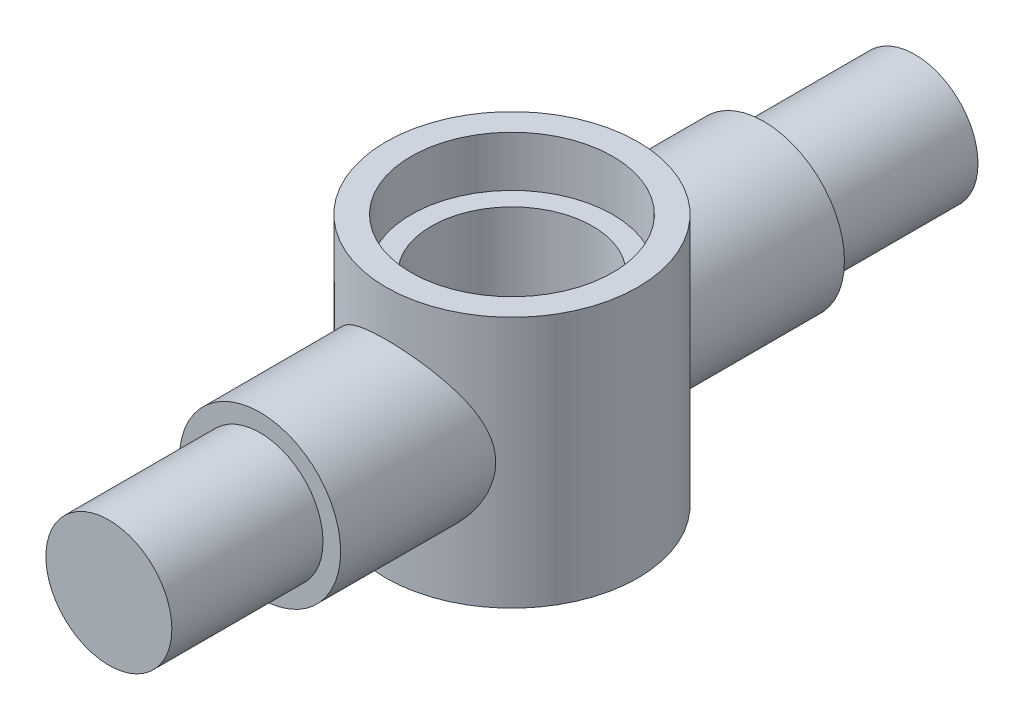
ISO-10303-21;
HEADER;
FILE_DESCRIPTION(('STEP AP214'),'2;1');
FILE_NAME('part.step','',(''),(''),'','','');
FILE_SCHEMA(('AUTOMOTIVE_DESIGN { 1 0 10303 214 1 1 1 1 }'));
ENDSEC;
DATA;
#1=APPLICATION_CONTEXT('core data for automotive mechanical design processes');
#2=APPLICATION_PROTOCOL_DEFINITION('international standard','automotive_design',2000,#1);
#3=PRODUCT_CONTEXT('',#1,'mechanical');
#4=PRODUCT('Part','Part','',(#3));
#5=PRODUCT_RELATED_PRODUCT_CATEGORY('part','',(#4));
#6=PRODUCT_DEFINITION_FORMATION('','',#4);
#7=PRODUCT_DEFINITION_CONTEXT('part definition',#1,'design');
#8=PRODUCT_DEFINITION('design','',#6,#7);
#9=PRODUCT_DEFINITION_SHAPE('','',#8);
#10=(LENGTH_UNIT() NAMED_UNIT(*) SI_UNIT(.MILLI.,.METRE.));
#11=(NAMED_UNIT(*) PLANE_ANGLE_UNIT() SI_UNIT($,.RADIAN.));
#12=(NAMED_UNIT(*) SI_UNIT($,.STERADIAN.) SOLID_ANGLE_UNIT());
#13=UNCERTAINTY_MEASURE_WITH_UNIT(LENGTH_MEASURE(1.E-05),#10,'distance_accuracy_value','');
#14=(GEOMETRIC_REPRESENTATION_CONTEXT(3) GLOBAL_UNCERTAINTY_ASSIGNED_CONTEXT((#13)) GLOBAL_UNIT_ASSIGNED_CONTEXT((#10,
#11,#12)) REPRESENTATION_CONTEXT('',''));
#15=CARTESIAN_POINT('',(0.,0.,0.));
#16=DIRECTION('',(0.,0.,1.));
#17=DIRECTION('',(1.,0.,0.));
#18=AXIS2_PLACEMENT_3D('',#15,#16,#17);
#19=CARTESIAN_POINT('',(0.,50.,0.));
#20=DIRECTION('',(0.,-1.,0.));
#21=DIRECTION('',(0.,0.,-1.));
#22=AXIS2_PLACEMENT_3D('',#19,#20,#21);
#23=CYLINDRICAL_SURFACE('',#22,25.);
#24=CARTESIAN_POINT('',(0.,50.,0.));
#25=DIRECTION('',(0.,1.,0.));
#26=DIRECTION('',(0.,0.,1.));
#27=AXIS2_PLACEMENT_3D('',#24,#25,#26);
#28=CIRCLE('',#27,25.);
#29=CARTESIAN_POINT('',(0.,50.,25.));
#30=VERTEX_POINT('',#29);
#31=EDGE_CURVE('E74',#30,#30,#28,.T.);
#32=ORIENTED_EDGE('',*,*,#31,.F.);
#33=EDGE_LOOP('',(#32));
#34=FACE_BOUND('',#33,.T.);
#35=CARTESIAN_POINT('',(0.,0.,0.));
#36=DIRECTION('',(0.,1.,0.));
#37=DIRECTION('',(0.,0.,1.));
#38=AXIS2_PLACEMENT_3D('',#35,#36,#37);
#39=CIRCLE('',#38,25.);
#40=CARTESIAN_POINT('',(0.,0.,25.));
#41=VERTEX_POINT('',#40);
#42=EDGE_CURVE('E69',#41,#41,#39,.T.);
#43=ORIENTED_EDGE('',*,*,#42,.T.);
#44=EDGE_LOOP('',(#43));
#45=FACE_BOUND('',#44,.T.);
#46=CARTESIAN_POINT('',(-16.,25.,19.2093727122985));
#47=CARTESIAN_POINT('',(-16.0000075518309,24.6045492581816,19.2093602004703));
#48=CARTESIAN_POINT('',(-15.985318558414,24.2091699772598,19.2216281701415));
#49=CARTESIAN_POINT('',(-15.9268763773465,23.421903187078,19.2700828129892));
#50=CARTESIAN_POINT('',(-15.8831138318214,23.0300168432567,19.3062771873145));
#51=CARTESIAN_POINT('',(-15.7672610060305,22.2525926454864,19.4010060093011));
#52=CARTESIAN_POINT('',(-15.695124927821,21.8670661104673,19.4595765701311));
#53=CARTESIAN_POINT('',(-15.5237584274562,21.1057493858748,19.5965538328847));
#54=CARTESIAN_POINT('',(-15.424528797624,20.7299589119321,19.6749599547327));
#55=CARTESIAN_POINT('',(-15.2013768268568,19.9935160869742,19.8478677138076));
#56=CARTESIAN_POINT('',(-15.0776843957441,19.6327580464953,19.9422183799563));
#57=CARTESIAN_POINT('',(-14.80639059605,18.924250129037,20.1444634718839));
#58=CARTESIAN_POINT('',(-14.6587856393959,18.5765022138799,20.2523599296603));
#59=CARTESIAN_POINT('',(-14.34092425358,17.895126630566,20.4786703313642));
#60=CARTESIAN_POINT('',(-14.1706687570999,17.5614983817486,20.5970838421642));
#61=CARTESIAN_POINT('',(-13.8085717175924,16.9091068308863,20.8415708471703));
#62=CARTESIAN_POINT('',(-13.6167287819958,16.5903444896942,20.9676448352993));
#63=CARTESIAN_POINT('',(-13.183726884198,15.9242806211114,21.2429784742916));
#64=CARTESIAN_POINT('',(-12.9394311786344,15.5793274314703,21.3929937414824));
#65=CARTESIAN_POINT('',(-12.4250119334488,14.910546335808,21.6958102059326));
#66=CARTESIAN_POINT('',(-12.1548867309956,14.5867197921224,21.8486115820407));
#67=CARTESIAN_POINT('',(-11.5895322792664,13.9609477949369,22.153690243193));
#68=CARTESIAN_POINT('',(-11.2942825562918,13.6590205653043,22.3059669935383));
#69=CARTESIAN_POINT('',(-10.6797634395583,13.0785353977139,22.6066292638259));
#70=CARTESIAN_POINT('',(-10.3604925764188,12.7999788915583,22.7550145449758));
#71=CARTESIAN_POINT('',(-9.65613685196289,12.2332924062818,23.0635047016872));
#72=CARTESIAN_POINT('',(-9.26787638476107,11.9485682189356,23.2226498605155));
#73=CARTESIAN_POINT('',(-8.46354327157018,11.4131743874628,23.5277165227615));
#74=CARTESIAN_POINT('',(-8.04746763026314,11.1625084197881,23.6736365980179));
#75=CARTESIAN_POINT('',(-7.19003859126286,10.6982235642847,23.9479803876146));
#76=CARTESIAN_POINT('',(-6.74870512893474,10.4845759809119,24.0764176374088));
#77=CARTESIAN_POINT('',(-5.84344355319203,10.0970999400992,24.311987912098));
#78=CARTESIAN_POINT('',(-5.37951982186269,9.92326379701105,24.4191250484791));
#79=CARTESIAN_POINT('',(-4.48282903672907,9.63438391379048,24.5985926447151));
#80=CARTESIAN_POINT('',(-4.05193075208176,9.51507500024326,24.6734013192139));
#81=CARTESIAN_POINT('',(-3.17853043332122,9.31249437499184,24.801040881362));
#82=CARTESIAN_POINT('',(-2.73602914024029,9.22922036781577,24.8538731689283));
#83=CARTESIAN_POINT('',(-1.84383752201984,9.10021251504481,24.9359332327917));
#84=CARTESIAN_POINT('',(-1.39415431610935,9.05444359259159,24.9651830643105));
#85=CARTESIAN_POINT('',(-0.491624497686981,9.00116975992862,24.9992426632786));
#86=CARTESIAN_POINT('',(-0.0387782840441687,8.99366010927911,25.0040554585505));
#87=CARTESIAN_POINT('',(0.801807020258257,9.01537545354764,24.9901621157745));
#88=CARTESIAN_POINT('',(1.18974170793274,9.03958043209938,24.9746698897481));
#89=CARTESIAN_POINT('',(1.96167918510343,9.11597662468062,24.925916743737));
#90=CARTESIAN_POINT('',(2.34568243394718,9.16816453027431,24.8926579243074));
#91=CARTESIAN_POINT('',(3.10709482157081,9.29983235826278,24.809124943467));
#92=CARTESIAN_POINT('',(3.48450368656138,9.37931341101356,24.7588500773314));
#93=CARTESIAN_POINT('',(4.23029490411503,9.56457796754724,24.6423835379046));
#94=CARTESIAN_POINT('',(4.59867687169072,9.67036259101151,24.5761911870474));
#95=CARTESIAN_POINT('',(5.3243786114757,9.90706404812005,24.429246979534));
#96=CARTESIAN_POINT('',(5.68169536247057,10.0379876765975,24.348491186878));
#97=CARTESIAN_POINT('',(6.38338290414122,10.3236269689296,24.1740178828328));
#98=CARTESIAN_POINT('',(6.72775387695177,10.4783422979018,24.0803005538868));
#99=CARTESIAN_POINT('',(7.40213203498125,10.8102257605063,23.88162522246));
#100=CARTESIAN_POINT('',(7.73213837982413,10.9873952054098,23.7766665635656));
#101=CARTESIAN_POINT('',(8.37663930224959,11.3628799931342,23.5573305378522));
#102=CARTESIAN_POINT('',(8.69113212810154,11.5611977159848,23.4429521112619));
#103=CARTESIAN_POINT('',(9.34261350029824,12.0042371177083,23.1916461498523));
#104=CARTESIAN_POINT('',(9.67737906939421,12.2516529122084,23.0537005367941));
#105=CARTESIAN_POINT('',(10.3249438913943,12.7702151284576,22.7710425195163));
#106=CARTESIAN_POINT('',(10.6377415534904,13.0413632655993,22.6263296265049));
#107=CARTESIAN_POINT('',(11.2408946521999,13.6064360220685,22.3328215884758));
#108=CARTESIAN_POINT('',(11.5312180082151,13.9003920427177,22.1840210043112));
#109=CARTESIAN_POINT('',(12.0880975088665,14.5096117899087,21.8855595984986));
#110=CARTESIAN_POINT('',(12.3546524680053,14.8248765778916,21.7358987343383));
#111=CARTESIAN_POINT('',(12.8986334479259,15.5212466263385,21.4181651432605));
#112=CARTESIAN_POINT('',(13.1723794101635,15.9053982409604,21.2504398360994));
#113=CARTESIAN_POINT('',(13.6863281692123,16.6989176047022,20.9231280377543));
#114=CARTESIAN_POINT('',(13.9265241972136,17.108290418343,20.7635431930463));
#115=CARTESIAN_POINT('',(14.3711052241852,17.9503518777134,20.4583462502362));
#116=CARTESIAN_POINT('',(14.5755420556062,18.3830055675749,20.3127140688785));
#117=CARTESIAN_POINT('',(14.8537397354869,19.0481785869778,20.1091927064436));
#118=CARTESIAN_POINT('',(14.9417198388729,19.2725716400392,20.043847548657));
#119=CARTESIAN_POINT('',(15.107928903543,19.7265824625255,19.9188677051513));
#120=CARTESIAN_POINT('',(15.1861554400349,19.9562015144521,19.8592344402921));
#121=CARTESIAN_POINT('',(15.3658713186935,20.5261329268779,19.720753651965));
#122=CARTESIAN_POINT('',(15.4616911152538,20.8691522212165,19.645552574875));
#123=CARTESIAN_POINT('',(15.6307339070693,21.5637409179206,19.5113255727846));
#124=CARTESIAN_POINT('',(15.7039626356712,21.9153081264513,19.4522955441895));
#125=CARTESIAN_POINT('',(15.8267893922012,22.6246848377517,19.3524938058948));
#126=CARTESIAN_POINT('',(15.8764165497243,22.9824860776706,19.3116995928931));
#127=CARTESIAN_POINT('',(15.9513955181358,23.7023398736547,19.2498146282199));
#128=CARTESIAN_POINT('',(15.9767470392006,24.0643924804241,19.2287241117882));
#129=CARTESIAN_POINT('',(16.0027787782538,24.7910859598436,19.2070655710883));
#130=CARTESIAN_POINT('',(16.0033853918814,25.1557313278929,19.2065587736387));
#131=CARTESIAN_POINT('',(15.9797303685735,25.8836464924773,19.2262437044411));
#132=CARTESIAN_POINT('',(15.9554686000853,26.2469162817255,19.2464355421881));
#133=CARTESIAN_POINT('',(15.8824686441804,26.9695650440577,19.306719348198));
#134=CARTESIAN_POINT('',(15.8337127062304,27.3289410021241,19.3468257479805));
#135=CARTESIAN_POINT('',(15.7124891921192,28.0410818833485,19.4454047345737));
#136=CARTESIAN_POINT('',(15.640021088041,28.3938466591333,19.5038777302888));
#137=CARTESIAN_POINT('',(15.4746735603332,29.081170032679,19.6353070822549));
#138=CARTESIAN_POINT('',(15.3824106552207,29.4159625021135,19.7078206333577));
#139=CARTESIAN_POINT('',(15.1773980264134,30.0760390487844,19.8661366285732));
#140=CARTESIAN_POINT('',(15.0646402631501,30.4013193363182,19.9519442856407));
#141=CARTESIAN_POINT('',(14.6970969552363,31.3611570206666,20.2259366590945));
#142=CARTESIAN_POINT('',(14.4129501324544,31.9800844569265,20.4307664709313));
#143=CARTESIAN_POINT('',(13.9025759153207,32.9297831111047,20.7791231934689));
#144=CARTESIAN_POINT('',(13.6990065677717,33.2763444691463,20.9141789774944));
#145=CARTESIAN_POINT('',(13.2676036626528,33.9515959954826,21.1904755475318));
#146=CARTESIAN_POINT('',(13.0397678161961,34.2802844735307,21.331716916245));
#147=CARTESIAN_POINT('',(12.5606127955534,34.9192080416672,21.6173286221359));
#148=CARTESIAN_POINT('',(12.3092685900815,35.2294228728555,21.7617021658761));
#149=CARTESIAN_POINT('',(11.7841200489597,35.83022156592,22.0504950386983));
#150=CARTESIAN_POINT('',(11.5103143710493,36.1208042527166,22.1949143700021));
#151=CARTESIAN_POINT('',(10.8895251971102,36.7320378290204,22.5068806894766));
#152=CARTESIAN_POINT('',(10.538258852383,37.0486339518646,22.6738912555057));
#153=CARTESIAN_POINT('',(9.80673841828236,37.6511856036189,22.9997454081353));
#154=CARTESIAN_POINT('',(9.42647951620012,37.9371360263668,23.1585876314467));
#155=CARTESIAN_POINT('',(8.63879825507577,38.4758482705846,23.4637861759484));
#156=CARTESIAN_POINT('',(8.23140006944534,38.7286390473383,23.6101533508035));
#157=CARTESIAN_POINT('',(7.60150490333191,39.0810166740321,23.8173475602848));
#158=CARTESIAN_POINT('',(7.38842079738174,39.1940015577088,23.8843490627493));
#159=CARTESIAN_POINT('',(6.9561840106391,39.4107587612229,24.013796129949));
#160=CARTESIAN_POINT('',(6.73702978339919,39.5145287045721,24.0762405186914));
#161=CARTESIAN_POINT('',(6.15995796925273,39.7717973408357,24.2320055848663));
#162=CARTESIAN_POINT('',(5.79759896313245,39.9178236369807,24.321400053688));
#163=CARTESIAN_POINT('',(5.06026412930273,40.1837844441139,24.4854315282584));
#164=CARTESIAN_POINT('',(4.68529059290352,40.3037236643405,24.5600711973213));
#165=CARTESIAN_POINT('',(3.92502403877746,40.5161154342713,24.6929742121902));
#166=CARTESIAN_POINT('',(3.53973755962498,40.6085849703693,24.7512476771231));
#167=CARTESIAN_POINT('',(2.76115486747054,40.7649509257018,24.8501510392655));
#168=CARTESIAN_POINT('',(2.36785850204888,40.8288468006774,24.8907806004012));
#169=CARTESIAN_POINT('',(1.57480221577733,40.9273404409633,24.9535312925749));
#170=CARTESIAN_POINT('',(1.1750251798211,40.9618403003625,24.9755905708137));
#171=CARTESIAN_POINT('',(0.373405625880867,41.0006746513738,25.0004272981601));
#172=CARTESIAN_POINT('',(-0.028436892246746,41.0050091408883,25.0032047459269));
#173=CARTESIAN_POINT('',(-0.83100122046503,40.9834476229949,24.9894083698085));
#174=CARTESIAN_POINT('',(-1.23172294687186,40.9575494156401,24.9728331376842));
#175=CARTESIAN_POINT('',(-2.02885267808103,40.8759022758456,24.9207400616191));
#176=CARTESIAN_POINT('',(-2.42526078816292,40.8201540736094,24.8852226810495));
#177=CARTESIAN_POINT('',(-3.19044626417196,40.68324665588,24.7984189745796));
#178=CARTESIAN_POINT('',(-3.55959149260967,40.6035527406556,24.7480444224836));
#179=CARTESIAN_POINT('',(-4.28906417390253,40.4189971904595,24.6320994030311));
#180=CARTESIAN_POINT('',(-4.64939200078241,40.3141366250765,24.5665295814812));
#181=CARTESIAN_POINT('',(-5.35928858254073,40.0803746063925,24.4214925565386));
#182=CARTESIAN_POINT('',(-5.70885670770435,39.9514717491141,24.3420245415617));
#183=CARTESIAN_POINT('',(-6.39556994704412,39.6708653525123,24.170683642612));
#184=CARTESIAN_POINT('',(-6.73271437514201,39.5191605563319,24.0788100748657));
#185=CARTESIAN_POINT('',(-7.41821218958757,39.1819204834618,23.8769190367743));
#186=CARTESIAN_POINT('',(-7.76548374262892,38.9946940329282,23.7660547293117));
#187=CARTESIAN_POINT('',(-8.44272462594595,38.5968623110591,23.533987358231));
#188=CARTESIAN_POINT('',(-8.77269325536514,38.3862560937994,23.4127838763452));
#189=CARTESIAN_POINT('',(-9.41447208281311,37.942948547228,23.1621773907135));
#190=CARTESIAN_POINT('',(-9.72627065030753,37.7102333113594,23.0327692434887));
#191=CARTESIAN_POINT('',(-10.3306501038477,37.224078988506,22.7681033449974));
#192=CARTESIAN_POINT('',(-10.6232290804345,36.9706378480088,22.6328450147247));
#193=CARTESIAN_POINT('',(-11.2316218874087,36.4038990021542,22.3378986081481));
#194=CARTESIAN_POINT('',(-11.5441559130474,36.0873722519175,22.1776354019021));
#195=CARTESIAN_POINT('',(-12.1416680025961,35.4296383547698,21.8562350326654));
#196=CARTESIAN_POINT('',(-12.4266419437925,35.0884275286712,21.6950977427163));
#197=CARTESIAN_POINT('',(-12.9679779160604,34.3824040458822,21.375928274595));
#198=CARTESIAN_POINT('',(-13.2243290079454,34.0175824491116,21.2178973024897));
#199=CARTESIAN_POINT('',(-13.7069324509098,33.2655641466632,20.9093760040417));
#200=CARTESIAN_POINT('',(-13.933190195594,32.8783714684274,20.7588843294593));
#201=CARTESIAN_POINT('',(-14.3245055255624,32.1385060989702,20.4904053646846));
#202=CARTESIAN_POINT('',(-14.4936962326903,31.7885980286682,20.3708181994352));
#203=CARTESIAN_POINT('',(-14.8074000887338,31.073973812237,20.1439415106924));
#204=CARTESIAN_POINT('',(-14.9519129345167,30.7092574842775,20.0366521382654));
#205=CARTESIAN_POINT('',(-15.2145325262258,29.9671449650777,19.837970972326));
#206=CARTESIAN_POINT('',(-15.3326973975323,29.5897788405435,19.7465442856356));
#207=CARTESIAN_POINT('',(-15.5414800751121,28.8236131858425,19.5826454523431));
#208=CARTESIAN_POINT('',(-15.6321080032873,28.4348179145226,19.5101663424499));
#209=CARTESIAN_POINT('',(-15.8044576067829,27.5445909311496,19.3709744142914));
#210=CARTESIAN_POINT('',(-15.8775776488039,27.0404132321506,19.3107841815136));
#211=CARTESIAN_POINT('',(-15.9753445575078,26.0241172230498,19.2299909394771));
#212=CARTESIAN_POINT('',(-15.9999902224795,25.5119987164076,19.2093889116359));
#213=CARTESIAN_POINT('',(-16.,25.,19.2093727122985));
#214=B_SPLINE_CURVE_WITH_KNOTS('',3,(#46,#47,#48,#49,#50,#51,#52,#53,#54,#55,#56,#57,#58,#59,
#60,#61,#62,#63,#64,#65,#66,#67,#68,#69,#70,#71,#72,#73,#74,#75,#76,#77,#78,#79,#80,#81,#82,#83,
#84,#85,#86,#87,#88,#89,#90,#91,#92,#93,#94,#95,#96,#97,#98,#99,#100,#101,#102,#103,#104,#105,
#106,#107,#108,#109,#110,#111,#112,#113,#114,#115,#116,#117,#118,#119,#120,#121,#122,#123,#124,
#125,#126,#127,#128,#129,#130,#131,#132,#133,#134,#135,#136,#137,#138,#139,#140,#141,#142,#143,
#144,#145,#146,#147,#148,#149,#150,#151,#152,#153,#154,#155,#156,#157,#158,#159,#160,#161,#162,
#163,#164,#165,#166,#167,#168,#169,#170,#171,#172,#173,#174,#175,#176,#177,#178,#179,#180,#181,
#182,#183,#184,#185,#186,#187,#188,#189,#190,#191,#192,#193,#194,#195,#196,#197,#198,#199,#200,
#201,#202,#203,#204,#205,#206,#207,#208,#209,#210,#211,#212,#213),.UNSPECIFIED.,.T.,.F.,(4,2,2,
2,2,2,2,2,2,2,2,2,2,2,2,2,2,2,2,2,2,2,2,2,2,2,2,2,2,2,2,2,2,2,2,2,2,2,2,2,2,2,2,2,2,2,2,2,2,2,2,
2,2,2,2,2,2,2,2,2,2,2,2,2,2,2,2,2,2,2,2,2,2,2,2,2,2,2,2,2,2,2,2,4),(0.,1.18577451563378,
2.3719308803307,3.56000973844409,4.74805385612807,5.92542182765323,7.10296662705879,
8.28046295368245,9.45803528219828,10.8023160446125,12.1466834064257,13.4921569662333,
14.8377128960858,16.3569602143826,17.876371399424,19.3945994612358,20.9125341796885,
22.2705040937009,23.6283874904697,24.9849994644068,26.3414433459186,27.5070310105171,
28.6724808974644,29.8379790577811,31.0035268391193,32.1693901015006,33.3352369551525,
34.5011519231031,35.667198242016,36.981484304163,38.2958654425361,39.6120894425728,
40.9283790552946,42.4284846788317,43.9288925178197,45.4271071822749,46.1760210388417,
46.9251207099888,48.0159853843354,49.1065729819124,50.1958110356673,51.2850620935235,
52.3775529210133,53.4700495277667,54.5633389938717,55.6566528021364,56.7198824116748,
57.783530000594,59.909660789382,61.1808078676573,62.4520749505808,63.7247114101544,
64.9974239758645,66.5001130296407,68.0030520722831,69.5046698733184,70.2553847672214,
71.0062927079441,72.2072677819863,73.408025875761,74.6080399052386,75.8080767910933,
77.0120950499146,78.2161133924544,79.4202193534208,80.6242958603644,81.766023444616,
82.9077025137562,84.0494482734539,85.1912569899845,86.4194532766275,87.647699273107,
88.8767230159272,90.105868677688,91.5228092826638,92.9399615210126,94.357653531239,
95.7750911063543,96.9939255712751,98.2127750067778,99.4289083750166,100.644594180297,
102.179804297619,103.715052473312),.UNSPECIFIED.);
#215=CARTESIAN_POINT('',(-16.,25.,19.2093727122985));
#216=VERTEX_POINT('',#215);
#217=EDGE_CURVE('E60',#216,#216,#214,.T.);
#218=ORIENTED_EDGE('',*,*,#217,.F.);
#219=EDGE_LOOP('',(#218));
#220=FACE_BOUND('',#219,.T.);
#221=CARTESIAN_POINT('',(0.,41.,-25.));
#222=CARTESIAN_POINT('',(0.404925044071176,41.0000018773157,-25.0000015619882));
#223=CARTESIAN_POINT('',(0.809832411815946,40.9846099706385,-24.9901420976649));
#224=CARTESIAN_POINT('',(1.61652618236302,40.92326968288,-24.9509510419688));
#225=CARTESIAN_POINT('',(2.01831137766447,40.8773100220158,-24.9216122625561));
#226=CARTESIAN_POINT('',(2.81604821037114,40.7554098701401,-24.8441286420605));
#227=CARTESIAN_POINT('',(3.2119905395922,40.6794259832054,-24.7959565811092));
#228=CARTESIAN_POINT('',(3.99456099671031,40.4985408355828,-24.6819740036757));
#229=CARTESIAN_POINT('',(4.38118985736236,40.3936418579784,-24.6161648797958));
#230=CARTESIAN_POINT('',(5.1407660907412,40.1568468243231,-24.468785547579));
#231=CARTESIAN_POINT('',(5.51377244407854,40.025089059471,-24.3872961899422));
#232=CARTESIAN_POINT('',(6.24609510158277,39.7357159583602,-24.2100855842812));
#233=CARTESIAN_POINT('',(6.60541118302289,39.5781002016396,-24.114364104839));
#234=CARTESIAN_POINT('',(7.30859986653981,39.2385667901493,-23.9106324755014));
#235=CARTESIAN_POINT('',(7.65247625422317,39.0566551363675,-23.8026253610819));
#236=CARTESIAN_POINT('',(8.32360019852907,38.6699562899151,-23.5763254629354));
#237=CARTESIAN_POINT('',(8.6508456270696,38.4651661804078,-23.4580313681202));
#238=CARTESIAN_POINT('',(9.31365412183655,38.0164828623738,-23.2032751229575));
#239=CARTESIAN_POINT('',(9.64771274316308,37.7707619235136,-23.0661182340287));
#240=CARTESIAN_POINT('',(10.2940617258667,37.2557366535805,-22.7850064089794));
#241=CARTESIAN_POINT('',(10.6063511058608,36.9864312605261,-22.6410511668713));
#242=CARTESIAN_POINT('',(11.2086687230747,36.4252092234652,-22.3490022897849));
#243=CARTESIAN_POINT('',(11.4986673651025,36.1332635184821,-22.2009034973146));
#244=CARTESIAN_POINT('',(12.0551203444099,35.5282019106555,-21.9037344054836));
#245=CARTESIAN_POINT('',(12.3215738378621,35.2150852497817,-21.7546640715094));
#246=CARTESIAN_POINT('',(12.8665793254927,34.5221997765781,-21.4374499122155));
#247=CARTESIAN_POINT('',(13.1413799496497,34.1393143835168,-21.2696389657507));
#248=CARTESIAN_POINT('',(13.6575524379486,33.348316185452,-20.9419379170098));
#249=CARTESIAN_POINT('',(13.8989175727052,32.9401983258787,-20.7820494133894));
#250=CARTESIAN_POINT('',(14.3459904698911,32.1005852468953,-20.4759821659353));
#251=CARTESIAN_POINT('',(14.5517467761611,31.6691229228491,-20.3297848843603));
#252=CARTESIAN_POINT('',(14.8320367864773,31.0056905539052,-20.1252100289451));
#253=CARTESIAN_POINT('',(14.9207331379766,30.7818697536247,-20.0594794225191));
#254=CARTESIAN_POINT('',(15.0884150598226,30.3289818989008,-19.9336577942813));
#255=CARTESIAN_POINT('',(15.16739817266,30.0999135341102,-19.8735682005867));
#256=CARTESIAN_POINT('',(15.3492623867947,29.5305522925355,-19.7336948385013));
#257=CARTESIAN_POINT('',(15.4464497728831,29.1875138920204,-19.6575477076493));
#258=CARTESIAN_POINT('',(15.6182136002394,28.4927653689972,-19.521358473509));
#259=CARTESIAN_POINT('',(15.6927957976356,28.1410574787733,-19.4613122707707));
#260=CARTESIAN_POINT('',(15.8183001813279,27.4312697270161,-19.3594402998739));
#261=CARTESIAN_POINT('',(15.8692520417559,27.0731984466394,-19.3175916839816));
#262=CARTESIAN_POINT('',(15.9468367737907,26.3526580128899,-19.2535956523238));
#263=CARTESIAN_POINT('',(15.9734693761403,25.9901888108692,-19.231448454688));
#264=CARTESIAN_POINT('',(16.0020035959886,25.2624601561507,-19.2077129340946));
#265=CARTESIAN_POINT('',(16.0038277150333,24.8971955246278,-19.2061890356968));
#266=CARTESIAN_POINT('',(15.9825126443981,24.1679085396005,-19.2239297577433));
#267=CARTESIAN_POINT('',(15.9593733307184,23.8038861922758,-19.24319448145));
#268=CARTESIAN_POINT('',(15.8885074198919,23.0796267177672,-19.3017467127909));
#269=CARTESIAN_POINT('',(15.8407632118421,22.7193924906237,-19.3410485617405));
#270=CARTESIAN_POINT('',(15.7214419318028,22.0054576089155,-19.4381624474468));
#271=CARTESIAN_POINT('',(15.6498643579324,21.6517570921026,-19.4959748739967));
#272=CARTESIAN_POINT('',(15.4863735674023,20.9634744139001,-19.6260739031015));
#273=CARTESIAN_POINT('',(15.3951393603923,20.6286374301095,-19.6978709558272));
#274=CARTESIAN_POINT('',(15.1921818732878,19.9683960247838,-19.8548252831694));
#275=CARTESIAN_POINT('',(15.0804505589621,19.6429953601167,-19.9399877947337));
#276=CARTESIAN_POINT('',(14.7159808896165,18.6827009914022,-20.2121658403417));
#277=CARTESIAN_POINT('',(14.4338764142666,18.0633405798088,-20.415946958597));
#278=CARTESIAN_POINT('',(13.9270311591719,17.1132901337182,-20.7627220180091));
#279=CARTESIAN_POINT('',(13.7249831568112,16.7668482633426,-20.8971209302017));
#280=CARTESIAN_POINT('',(13.2966961611891,16.0917151921997,-21.1722128751606));
#281=CARTESIAN_POINT('',(13.0704549086854,15.7630256535223,-21.3129064950318));
#282=CARTESIAN_POINT('',(12.5945655171766,15.1239754492574,-21.5975435918726));
#283=CARTESIAN_POINT('',(12.3448925721126,14.8136347882492,-21.741490387645));
#284=CARTESIAN_POINT('',(11.8231591635811,14.2124462813183,-22.0295648350163));
#285=CARTESIAN_POINT('',(11.5510973496357,13.9215996131797,-22.1736924970078));
#286=CARTESIAN_POINT('',(10.9336594778248,13.3091009870803,-22.4854503237814));
#287=CARTESIAN_POINT('',(10.5839664649273,12.9915185266083,-22.6525676241314));
#288=CARTESIAN_POINT('',(9.8555843035405,12.3868494316262,-22.9788334546104));
#289=CARTESIAN_POINT('',(9.47689033099588,12.0997678897196,-23.1379806516688));
#290=CARTESIAN_POINT('',(8.69230147452354,11.5586211204492,-23.4439951491245));
#291=CARTESIAN_POINT('',(8.28643015897214,11.304527833401,-23.5908728474814));
#292=CARTESIAN_POINT('',(7.65877791158847,10.9500577090412,-23.7989867549893));
#293=CARTESIAN_POINT('',(7.4464333327303,10.8363521766546,-23.8663204968941));
#294=CARTESIAN_POINT('',(7.01565570471916,10.6181056026268,-23.9964832307619));
#295=CARTESIAN_POINT('',(6.7972211030367,10.5135669265738,-24.0593110591769));
#296=CARTESIAN_POINT('',(6.221177029096,10.2538707537965,-24.2163596379815));
#297=CARTESIAN_POINT('',(5.85907262264255,10.1062029668147,-24.3066645830134));
#298=CARTESIAN_POINT('',(5.12210088957016,9.83695374756055,-24.472571043401));
#299=CARTESIAN_POINT('',(4.74723587549782,9.71536761748444,-24.5481752064179));
#300=CARTESIAN_POINT('',(3.98702789616477,9.49969066602975,-24.6830408717459));
#301=CARTESIAN_POINT('',(3.60169155725474,9.4055828794762,-24.7423124565402));
#302=CARTESIAN_POINT('',(2.82284294906275,9.24596649888971,-24.8432233011495));
#303=CARTESIAN_POINT('',(2.42933052825376,9.18045843539058,-24.8848622338729));
#304=CARTESIAN_POINT('',(1.63564062619809,9.0787789515302,-24.9496239299749));
#305=CARTESIAN_POINT('',(1.23544504541877,9.04270793847392,-24.9726833167173));
#306=CARTESIAN_POINT('',(0.4328226762997,9.00080785552046,-24.999477761314));
#307=CARTESIAN_POINT('',(0.0303958874795315,8.99497879213532,-25.003212815007));
#308=CARTESIAN_POINT('',(-0.773483996299092,9.01365018276063,-24.9912650807508));
#309=CARTESIAN_POINT('',(-1.17493703163254,9.03815244928052,-24.9755811323802));
#310=CARTESIAN_POINT('',(-1.97366097901495,9.11712537313447,-24.9251836971058));
#311=CARTESIAN_POINT('',(-2.37093199910753,9.17159525430005,-24.8904707030591));
#312=CARTESIAN_POINT('',(-3.13731209509079,9.30603655023218,-24.8052000041332));
#313=CARTESIAN_POINT('',(-3.50679388900717,9.3844946298961,-24.7555850388601));
#314=CARTESIAN_POINT('',(-4.23704308721494,9.56662473189511,-24.6411050211604));
#315=CARTESIAN_POINT('',(-4.59781087058802,9.67029565522763,-24.5762406334449));
#316=CARTESIAN_POINT('',(-5.30867908099265,9.90173272562199,-24.4325489543541));
#317=CARTESIAN_POINT('',(-5.65877880490656,10.0295004568997,-24.3537207449646));
#318=CARTESIAN_POINT('',(-6.34662960165229,10.3078939765913,-24.1835862363121));
#319=CARTESIAN_POINT('',(-6.68437999452992,10.4585210212942,-24.092279251275));
#320=CARTESIAN_POINT('',(-7.37070229752056,10.7933415208523,-23.8916275742825));
#321=CARTESIAN_POINT('',(-7.71821923165122,10.9791958482723,-23.7814473707268));
#322=CARTESIAN_POINT('',(-8.39605638651568,11.3742831896931,-23.5506783083945));
#323=CARTESIAN_POINT('',(-8.72637593215574,11.5835171204612,-23.430089041497));
#324=CARTESIAN_POINT('',(-9.36895085200482,12.0240758531963,-23.180630204464));
#325=CARTESIAN_POINT('',(-9.68119493171718,12.2554142329434,-23.0517555610962));
#326=CARTESIAN_POINT('',(-10.2865613887257,12.7388122830541,-22.7880601838735));
#327=CARTESIAN_POINT('',(-10.579681824615,12.9908740513759,-22.6532388486398));
#328=CARTESIAN_POINT('',(-11.1893099340712,13.5546068254572,-22.3591293702995));
#329=CARTESIAN_POINT('',(-11.5025558397825,13.8695032305678,-22.1992483653671));
#330=CARTESIAN_POINT('',(-12.1016246389836,14.5239546134945,-21.8784405932856));
#331=CARTESIAN_POINT('',(-12.3874436172205,14.8635130997567,-21.7175136803215));
#332=CARTESIAN_POINT('',(-12.9305814468634,15.5661622512144,-21.3985808420018));
#333=CARTESIAN_POINT('',(-13.1878931678842,15.9292587680283,-21.2405756556402));
#334=CARTESIAN_POINT('',(-13.6725981697187,16.677811486941,-20.9318561584343));
#335=CARTESIAN_POINT('',(-13.8999959805734,17.0632642907263,-20.7811407458473));
#336=CARTESIAN_POINT('',(-14.2944225726149,17.8013958844256,-20.5114248571981));
#337=CARTESIAN_POINT('',(-14.4654551193313,18.1513806295169,-20.3909016210024));
#338=CARTESIAN_POINT('',(-14.7827501975162,18.8662279975313,-20.1620574047654));
#339=CARTESIAN_POINT('',(-14.9290175376039,19.231087715095,-20.0537340572626));
#340=CARTESIAN_POINT('',(-15.1952420148147,19.9740530149101,-19.8527690015487));
#341=CARTESIAN_POINT('',(-15.315227506719,20.352143806461,-19.7601104179272));
#342=CARTESIAN_POINT('',(-15.5275641940392,21.1201249533517,-19.5936975313565));
#343=CARTESIAN_POINT('',(-15.6199157311731,21.5100151627158,-19.5199429946438));
#344=CARTESIAN_POINT('',(-15.7762650376,22.3029138525299,-19.3938056687495));
#345=CARTESIAN_POINT('',(-15.8399800811272,22.7060127116382,-19.3416363723446));
#346=CARTESIAN_POINT('',(-15.9364986807434,23.5183552221538,-19.2621898317534));
#347=CARTESIAN_POINT('',(-15.9693030364411,23.9275987143313,-19.2349119436678));
#348=CARTESIAN_POINT('',(-16.0032809353728,24.7480621179853,-19.2066524645509));
#349=CARTESIAN_POINT('',(-16.004473879882,25.1592806622595,-19.2056547442586));
#350=CARTESIAN_POINT('',(-15.9752468012828,25.9797826192125,-19.2299728056356));
#351=CARTESIAN_POINT('',(-15.9448292973182,26.3890661834853,-19.2552864904598));
#352=CARTESIAN_POINT('',(-15.8596997261338,27.1429859770789,-19.3254345723058));
#353=CARTESIAN_POINT('',(-15.8091331210736,27.4884181716534,-19.3669198547315));
#354=CARTESIAN_POINT('',(-15.6860828655746,28.1729747629245,-19.4667172401765));
#355=CARTESIAN_POINT('',(-15.6135929841754,28.512097337196,-19.5250341268026));
#356=CARTESIAN_POINT('',(-15.4475564981701,29.1823807420757,-19.6566579347328));
#357=CARTESIAN_POINT('',(-15.3539965127064,29.5135363645932,-19.7299743789902));
#358=CARTESIAN_POINT('',(-15.1468238889593,30.1663373347986,-19.8894647238651));
#359=CARTESIAN_POINT('',(-15.0332085416725,30.4879813908382,-19.9756403612109));
#360=CARTESIAN_POINT('',(-14.7443693949179,31.2299347962595,-20.1902486625657));
#361=CARTESIAN_POINT('',(-14.5614134998204,31.6460017971692,-20.3230031980176));
#362=CARTESIAN_POINT('',(-14.1631148541737,32.4572414765032,-20.6025569184015));
#363=CARTESIAN_POINT('',(-13.9477728978596,32.8524146670057,-20.7493557588791));
#364=CARTESIAN_POINT('',(-13.4861556789325,33.6211873413844,-21.0523136209136));
#365=CARTESIAN_POINT('',(-13.239841918056,33.9947591158727,-21.2084841630588));
#366=CARTESIAN_POINT('',(-12.7179541719606,34.7186804971156,-21.5254932104697));
#367=CARTESIAN_POINT('',(-12.442382341833,35.0690318111599,-21.6863313712946));
#368=CARTESIAN_POINT('',(-11.859716150561,35.7494224070127,-22.010442238798));
#369=CARTESIAN_POINT('',(-11.5522878757903,36.0791728601149,-22.1737212606611));
#370=CARTESIAN_POINT('',(-10.9097759508097,36.7123977011906,-22.4968024507648));
#371=CARTESIAN_POINT('',(-10.5746917197737,37.0158715370321,-22.6566045458943));
#372=CARTESIAN_POINT('',(-9.87788824812157,37.5949385398338,-22.9689581645052));
#373=CARTESIAN_POINT('',(-9.51616584039964,37.8705283822917,-23.1215088222784));
#374=CARTESIAN_POINT('',(-8.9548085940757,38.2613498914431,-23.3420621846537));
#375=CARTESIAN_POINT('',(-8.76455786261009,38.3878647497722,-23.4142021245946));
#376=CARTESIAN_POINT('',(-8.37789362684305,38.6331707030461,-23.5553237080331));
#377=CARTESIAN_POINT('',(-8.18147784307571,38.7519588900481,-23.6243041595969));
#378=CARTESIAN_POINT('',(-7.57072389698191,39.1035237172432,-23.8300744697518));
#379=CARTESIAN_POINT('',(-7.14672497942356,39.323210508379,-23.9609814020929));
#380=CARTESIAN_POINT('',(-6.27620668494684,39.7254539287129,-24.2035792788676));
#381=CARTESIAN_POINT('',(-5.82969121870039,39.9080169780295,-24.3152735453922));
#382=CARTESIAN_POINT('',(-5.14619804504746,40.1517335983943,-24.4657106327018));
#383=CARTESIAN_POINT('',(-4.91633650685715,40.2278849584961,-24.5129636821995));
#384=CARTESIAN_POINT('',(-4.45240645515486,40.3699361290149,-24.6014604241758));
#385=CARTESIAN_POINT('',(-4.21833910749466,40.4358387329389,-24.6427057539856));
#386=CARTESIAN_POINT('',(-3.51078593222695,40.6176557338748,-24.756860888756));
#387=CARTESIAN_POINT('',(-3.03154239159498,40.7178247777842,-24.8202802251292));
#388=CARTESIAN_POINT('',(-2.12784973800439,40.8635762871447,-24.912855714342));
#389=CARTESIAN_POINT('',(-1.70461817648609,40.9146575501143,-24.9454536896083));
#390=CARTESIAN_POINT('',(-0.854251246410929,40.982868800304,-24.989025253133));
#391=CARTESIAN_POINT('',(-0.427115789798926,40.9999980198034,-24.9999983524116));
#392=CARTESIAN_POINT('',(0.,41.,-25.));
#393=B_SPLINE_CURVE_WITH_KNOTS('',3,(#221,#222,#223,#224,#225,#226,#227,#228,#229,#230,#231,
#232,#233,#234,#235,#236,#237,#238,#239,#240,#241,#242,#243,#244,#245,#246,#247,#248,#249,#250,
#251,#252,#253,#254,#255,#256,#257,#258,#259,#260,#261,#262,#263,#264,#265,#266,#267,#268,#269,
#270,#271,#272,#273,#274,#275,#276,#277,#278,#279,#280,#281,#282,#283,#284,#285,#286,#287,#288,
#289,#290,#291,#292,#293,#294,#295,#296,#297,#298,#299,#300,#301,#302,#303,#304,#305,#306,#307,
#308,#309,#310,#311,#312,#313,#314,#315,#316,#317,#318,#319,#320,#321,#322,#323,#324,#325,#326,
#327,#328,#329,#330,#331,#332,#333,#334,#335,#336,#337,#338,#339,#340,#341,#342,#343,#344,#345,
#346,#347,#348,#349,#350,#351,#352,#353,#354,#355,#356,#357,#358,#359,#360,#361,#362,#363,#364,
#365,#366,#367,#368,#369,#370,#371,#372,#373,#374,#375,#376,#377,#378,#379,#380,#381,#382,#383,
#384,#385,#386,#387,#388,#389,#390,#391,#392),.UNSPECIFIED.,.T.,.F.,(4,2,2,2,2,2,2,2,2,2,2,2,2,
2,2,2,2,2,2,2,2,2,2,2,2,2,2,2,2,2,2,2,2,2,2,2,2,2,2,2,2,2,2,2,2,2,2,2,2,2,2,2,2,2,2,2,2,2,2,2,2,
2,2,2,2,2,2,2,2,2,2,2,2,2,2,2,2,2,2,2,2,2,2,2,2,4),(0.,1.21433590372909,2.42912015739384,
3.64566667645103,4.86211716668028,6.07245576879059,7.2828140534746,8.49287393554705,
9.70308826789616,11.0121682302353,12.3213071693168,13.6321552474755,14.9430502856901,
16.4420715483407,17.9413940741466,19.4386562617971,20.1870950354631,20.9357227808739,
22.0283192451477,23.1206372592161,24.2115798402962,25.3025344998955,26.3968963790282,
27.4912636941612,28.5864153906037,29.6815901501144,30.7437087697947,31.8062446000701,
33.9301496941282,35.1981954835546,36.4663597906896,37.7358821242904,39.0054810906213,
40.5068568446585,42.0084828841258,43.5088231589307,44.258900518937,45.0091708768569,
46.2118707177269,47.4143537471899,48.6160927841587,49.8178541128161,51.0236976145029,
52.2295413758452,53.4354571982781,54.6413417886698,55.7829773658004,56.9245631890967,
58.0662240907687,59.2079477579223,60.4343408374661,61.6607820235585,62.8879814611388,
64.1153052891324,65.5300085169597,66.9449133972259,68.3601713857365,69.775214806001,
70.997381541078,72.2193106972437,73.4399149816459,74.6605041715842,75.8928927793549,
77.1252495063834,78.3568498658441,79.5883520824207,80.6419106900126,81.6957690183668,
82.7502985106615,83.8049705540183,85.2234889733917,86.6419726107123,88.0622371979518,
89.4823972438031,90.9193332530907,92.3562994483688,93.7934367662636,94.5120249362064,
95.2308820013993,96.7140532599454,98.1969678027554,98.9368252382388,99.6764806557274,
101.154474230587,102.435329338598,103.716213408864),.UNSPECIFIED.);
#394=CARTESIAN_POINT('',(0.,41.,-25.));
#395=VERTEX_POINT('',#394);
#396=EDGE_CURVE('E54',#395,#395,#393,.T.);
#397=ORIENTED_EDGE('',*,*,#396,.F.);
#398=EDGE_LOOP('',(#397));
#399=FACE_BOUND('',#398,.T.);
#400=ADVANCED_FACE('F45',(#34,#45,#220,#399),#23,.T.);
#401=CARTESIAN_POINT('',(0.,50.,0.));
#402=DIRECTION('',(0.,1.,0.));
#403=DIRECTION('',(0.,0.,1.));
#404=AXIS2_PLACEMENT_3D('',#401,#402,#403);
#405=PLANE('',#404);
#406=CARTESIAN_POINT('',(0.,50.,0.));
#407=DIRECTION('',(0.,1.,0.));
#408=DIRECTION('',(0.,0.,1.));
#409=AXIS2_PLACEMENT_3D('',#406,#407,#408);
#410=CIRCLE('',#409,20.);
#411=CARTESIAN_POINT('',(0.,50.,20.));
#412=VERTEX_POINT('',#411);
#413=EDGE_CURVE('E241',#412,#412,#410,.T.);
#414=ORIENTED_EDGE('',*,*,#413,.F.);
#415=EDGE_LOOP('',(#414));
#416=FACE_BOUND('',#415,.T.);
#417=ORIENTED_EDGE('',*,*,#31,.T.);
#418=EDGE_LOOP('',(#417));
#419=FACE_BOUND('',#418,.T.);
#420=ADVANCED_FACE('F99',(#416,#419),#405,.T.);
#421=CARTESIAN_POINT('',(0.,0.,0.));
#422=DIRECTION('',(0.,1.,0.));
#423=DIRECTION('',(0.,0.,1.));
#424=AXIS2_PLACEMENT_3D('',#421,#422,#423);
#425=PLANE('',#424);
#426=CARTESIAN_POINT('',(0.,0.,0.));
#427=DIRECTION('',(0.,1.,0.));
#428=DIRECTION('',(0.,0.,1.));
#429=AXIS2_PLACEMENT_3D('',#426,#427,#428);
#430=CIRCLE('',#429,16.);
#431=CARTESIAN_POINT('',(0.,0.,16.));
#432=VERTEX_POINT('',#431);
#433=EDGE_CURVE('E251',#432,#432,#430,.T.);
#434=ORIENTED_EDGE('',*,*,#433,.T.);
#435=EDGE_LOOP('',(#434));
#436=FACE_BOUND('',#435,.T.);
#437=ORIENTED_EDGE('',*,*,#42,.F.);
#438=EDGE_LOOP('',(#437));
#439=FACE_BOUND('',#438,.T.);
#440=ADVANCED_FACE('F102',(#436,#439),#425,.F.);
#441=CARTESIAN_POINT('',(0.,25.,50.));
#442=DIRECTION('',(0.,0.,1.));
#443=DIRECTION('',(1.,0.,0.));
#444=AXIS2_PLACEMENT_3D('',#441,#442,#443);
#445=PLANE('',#444);
#446=CARTESIAN_POINT('',(0.,25.,50.));
#447=DIRECTION('',(0.,0.,1.));
#448=DIRECTION('',(1.,0.,0.));
#449=AXIS2_PLACEMENT_3D('',#446,#447,#448);
#450=CIRCLE('',#449,12.5);
#451=CARTESIAN_POINT('',(12.5,25.,50.));
#452=VERTEX_POINT('',#451);
#453=EDGE_CURVE('E10',#452,#452,#450,.T.);
#454=ORIENTED_EDGE('',*,*,#453,.F.);
#455=EDGE_LOOP('',(#454));
#456=FACE_BOUND('',#455,.T.);
#457=CARTESIAN_POINT('',(0.,25.,50.));
#458=DIRECTION('',(0.,0.,1.));
#459=DIRECTION('',(1.,0.,0.));
#460=AXIS2_PLACEMENT_3D('',#457,#458,#459);
#461=CIRCLE('',#460,16.);
#462=CARTESIAN_POINT('',(16.,25.,50.));
#463=VERTEX_POINT('',#462);
#464=EDGE_CURVE('E65',#463,#463,#461,.T.);
#465=ORIENTED_EDGE('',*,*,#464,.T.);
#466=EDGE_LOOP('',(#465));
#467=FACE_BOUND('',#466,.T.);
#468=ADVANCED_FACE('F105',(#456,#467),#445,.T.);
#469=CARTESIAN_POINT('',(0.,25.,50.));
#470=DIRECTION('',(0.,0.,-1.));
#471=DIRECTION('',(-1.,0.,0.));
#472=AXIS2_PLACEMENT_3D('',#469,#470,#471);
#473=CYLINDRICAL_SURFACE('',#472,16.);
#474=ORIENTED_EDGE('',*,*,#464,.F.);
#475=EDGE_LOOP('',(#474));
#476=FACE_BOUND('',#475,.T.);
#477=ORIENTED_EDGE('',*,*,#217,.T.);
#478=EDGE_LOOP('',(#477));
#479=FACE_BOUND('',#478,.T.);
#480=ADVANCED_FACE('F96',(#476,#479),#473,.T.);
#481=CARTESIAN_POINT('',(0.,25.,-50.));
#482=DIRECTION('',(0.,0.,1.));
#483=DIRECTION('',(1.,0.,0.));
#484=AXIS2_PLACEMENT_3D('',#481,#482,#483);
#485=CIRCLE('',#484,16.);
#486=CARTESIAN_POINT('',(16.,25.,-50.));
#487=VERTEX_POINT('',#486);
#488=EDGE_CURVE('E70',#487,#487,#485,.T.);
#489=ORIENTED_EDGE('',*,*,#488,.T.);
#490=EDGE_LOOP('',(#489));
#491=FACE_BOUND('',#490,.T.);
#492=ORIENTED_EDGE('',*,*,#396,.T.);
#493=EDGE_LOOP('',(#492));
#494=FACE_BOUND('',#493,.T.);
#495=ADVANCED_FACE('F90',(#491,#494),#473,.T.);
#496=CARTESIAN_POINT('',(0.,25.,-50.));
#497=DIRECTION('',(0.,0.,1.));
#498=DIRECTION('',(1.,0.,0.));
#499=AXIS2_PLACEMENT_3D('',#496,#497,#498);
#500=PLANE('',#499);
#501=CARTESIAN_POINT('',(0.,25.,-50.));
#502=DIRECTION('',(0.,0.,1.));
#503=DIRECTION('',(1.,0.,0.));
#504=AXIS2_PLACEMENT_3D('',#501,#502,#503);
#505=CIRCLE('',#504,12.5);
#506=CARTESIAN_POINT('',(12.5,25.,-50.));
#507=VERTEX_POINT('',#506);
#508=EDGE_CURVE('E49',#507,#507,#505,.T.);
#509=ORIENTED_EDGE('',*,*,#508,.T.);
#510=EDGE_LOOP('',(#509));
#511=FACE_BOUND('',#510,.T.);
#512=ORIENTED_EDGE('',*,*,#488,.F.);
#513=EDGE_LOOP('',(#512));
#514=FACE_BOUND('',#513,.T.);
#515=ADVANCED_FACE('F95',(#511,#514),#500,.F.);
#516=CARTESIAN_POINT('',(0.,25.,-80.));
#517=DIRECTION('',(0.,0.,1.));
#518=DIRECTION('',(1.,0.,0.));
#519=AXIS2_PLACEMENT_3D('',#516,#517,#518);
#520=PLANE('',#519);
#521=CARTESIAN_POINT('',(0.,25.,-80.));
#522=DIRECTION('',(0.,0.,1.));
#523=DIRECTION('',(1.,0.,0.));
#524=AXIS2_PLACEMENT_3D('',#521,#522,#523);
#525=CIRCLE('',#524,12.5);
#526=CARTESIAN_POINT('',(12.5,25.,-80.));
#527=VERTEX_POINT('',#526);
#528=EDGE_CURVE('E63',#527,#527,#525,.T.);
#529=ORIENTED_EDGE('',*,*,#528,.F.);
#530=EDGE_LOOP('',(#529));
#531=FACE_BOUND('',#530,.T.);
#532=ADVANCED_FACE('F150',(#531),#520,.F.);
#533=CARTESIAN_POINT('',(0.,25.,-80.));
#534=DIRECTION('',(0.,0.,1.));
#535=DIRECTION('',(1.,0.,0.));
#536=AXIS2_PLACEMENT_3D('',#533,#534,#535);
#537=CYLINDRICAL_SURFACE('',#536,12.5);
#538=ORIENTED_EDGE('',*,*,#528,.T.);
#539=EDGE_LOOP('',(#538));
#540=FACE_BOUND('',#539,.T.);
#541=ORIENTED_EDGE('',*,*,#508,.F.);
#542=EDGE_LOOP('',(#541));
#543=FACE_BOUND('',#542,.T.);
#544=ADVANCED_FACE('F158',(#540,#543),#537,.T.);
#545=ORIENTED_EDGE('',*,*,#453,.T.);
#546=EDGE_LOOP('',(#545));
#547=FACE_BOUND('',#546,.T.);
#548=CARTESIAN_POINT('',(0.,25.,80.));
#549=DIRECTION('',(0.,0.,1.));
#550=DIRECTION('',(1.,0.,0.));
#551=AXIS2_PLACEMENT_3D('',#548,#549,#550);
#552=CIRCLE('',#551,12.5);
#553=CARTESIAN_POINT('',(12.5,25.,80.));
#554=VERTEX_POINT('',#553);
#555=EDGE_CURVE('E256',#554,#554,#552,.T.);
#556=ORIENTED_EDGE('',*,*,#555,.F.);
#557=EDGE_LOOP('',(#556));
#558=FACE_BOUND('',#557,.T.);
#559=ADVANCED_FACE('F167',(#547,#558),#537,.T.);
#560=CARTESIAN_POINT('',(0.,25.,80.));
#561=DIRECTION('',(0.,0.,1.));
#562=DIRECTION('',(1.,0.,0.));
#563=AXIS2_PLACEMENT_3D('',#560,#561,#562);
#564=PLANE('',#563);
#565=ORIENTED_EDGE('',*,*,#555,.T.);
#566=EDGE_LOOP('',(#565));
#567=FACE_BOUND('',#566,.T.);
#568=ADVANCED_FACE('F176',(#567),#564,.T.);
#569=CARTESIAN_POINT('',(0.,55.,0.));
#570=DIRECTION('',(0.,1.,0.));
#571=DIRECTION('',(0.,0.,1.));
#572=AXIS2_PLACEMENT_3D('',#569,#570,#571);
#573=CYLINDRICAL_SURFACE('',#572,16.);
#574=CARTESIAN_POINT('',(0.,40.,0.));
#575=DIRECTION('',(0.,1.,0.));
#576=DIRECTION('',(0.,0.,1.));
#577=AXIS2_PLACEMENT_3D('',#574,#575,#576);
#578=CIRCLE('',#577,16.);
#579=CARTESIAN_POINT('',(0.,40.,16.));
#580=VERTEX_POINT('',#579);
#581=EDGE_CURVE('E246',#580,#580,#578,.T.);
#582=ORIENTED_EDGE('',*,*,#581,.T.);
#583=EDGE_LOOP('',(#582));
#584=FACE_BOUND('',#583,.T.);
#585=ORIENTED_EDGE('',*,*,#433,.F.);
#586=EDGE_LOOP('',(#585));
#587=FACE_BOUND('',#586,.T.);
#588=ADVANCED_FACE('F182',(#584,#587),#573,.F.);
#589=CARTESIAN_POINT('',(16.,40.,0.));
#590=DIRECTION('',(0.,1.,0.));
#591=DIRECTION('',(0.,0.,1.));
#592=AXIS2_PLACEMENT_3D('',#589,#590,#591);
#593=PLANE('',#592);
#594=CARTESIAN_POINT('',(0.,40.,0.));
#595=DIRECTION('',(0.,1.,0.));
#596=DIRECTION('',(0.,0.,1.));
#597=AXIS2_PLACEMENT_3D('',#594,#595,#596);
#598=CIRCLE('',#597,20.);
#599=CARTESIAN_POINT('',(0.,40.,20.));
#600=VERTEX_POINT('',#599);
#601=EDGE_CURVE('E244',#600,#600,#598,.T.);
#602=ORIENTED_EDGE('',*,*,#601,.T.);
#603=EDGE_LOOP('',(#602));
#604=FACE_BOUND('',#603,.T.);
#605=ORIENTED_EDGE('',*,*,#581,.F.);
#606=EDGE_LOOP('',(#605));
#607=FACE_BOUND('',#606,.T.);
#608=ADVANCED_FACE('F214',(#604,#607),#593,.T.);
#609=CARTESIAN_POINT('',(0.,55.,0.));
#610=DIRECTION('',(0.,1.,0.));
#611=DIRECTION('',(0.,0.,1.));
#612=AXIS2_PLACEMENT_3D('',#609,#610,#611);
#613=CYLINDRICAL_SURFACE('',#612,20.);
#614=ORIENTED_EDGE('',*,*,#413,.T.);
#615=EDGE_LOOP('',(#614));
#616=FACE_BOUND('',#615,.T.);
#617=ORIENTED_EDGE('',*,*,#601,.F.);
#618=EDGE_LOOP('',(#617));
#619=FACE_BOUND('',#618,.T.);
#620=ADVANCED_FACE('F223',(#616,#619),#613,.F.);
#621=CLOSED_SHELL('',(#400,#420,#440,#468,#480,#495,#515,#532,#544,#559,#568,#588,#608,#620));
#622=MANIFOLD_SOLID_BREP('B2',#621);
#623=ADVANCED_BREP_SHAPE_REPRESENTATION('',(#18,#622),#14);
#624=SHAPE_DEFINITION_REPRESENTATION(#9,#623);
ENDSEC;
END-ISO-10303-21;
